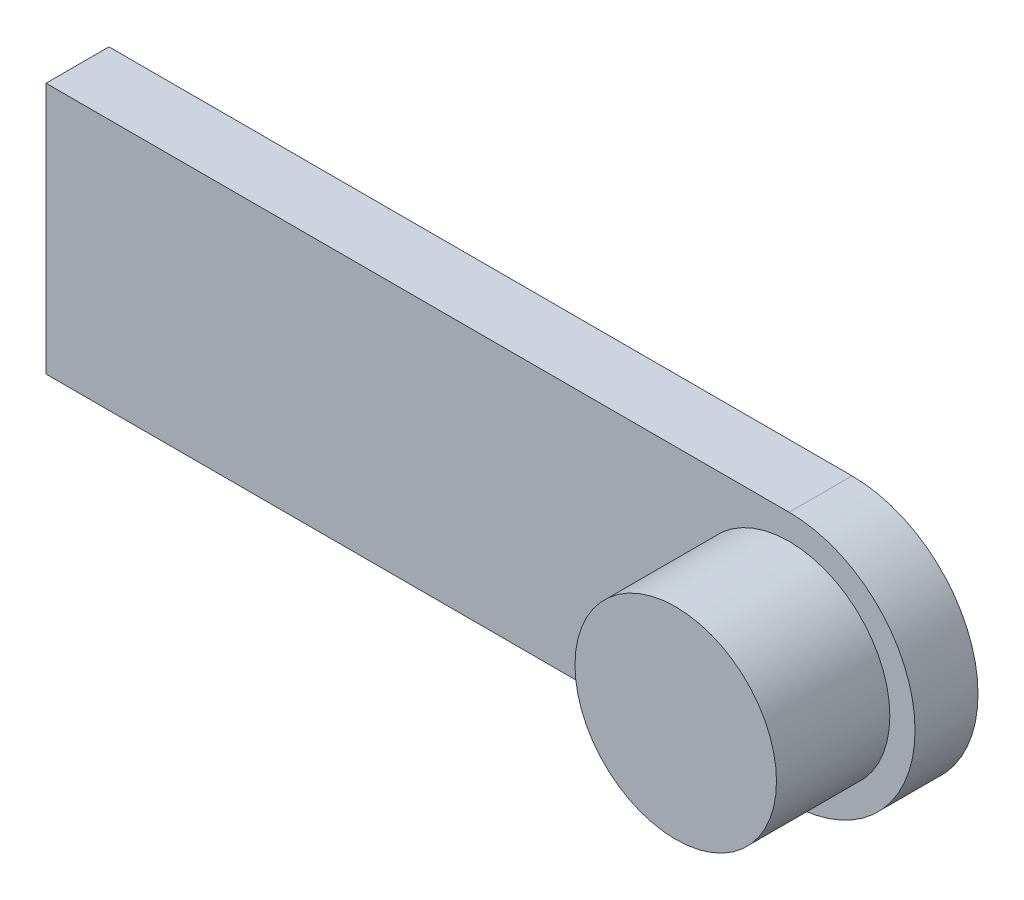
ISO-10303-21;
HEADER;
FILE_DESCRIPTION(('STEP AP214'),'2;1');
FILE_NAME('part.step','',(''),(''),'','','');
FILE_SCHEMA(('AUTOMOTIVE_DESIGN { 1 0 10303 214 1 1 1 1 }'));
ENDSEC;
DATA;
#1=APPLICATION_CONTEXT('core data for automotive mechanical design processes');
#2=APPLICATION_PROTOCOL_DEFINITION('international standard','automotive_design',2000,#1);
#3=PRODUCT_CONTEXT('',#1,'mechanical');
#4=PRODUCT('Part','Part','',(#3));
#5=PRODUCT_RELATED_PRODUCT_CATEGORY('part','',(#4));
#6=PRODUCT_DEFINITION_FORMATION('','',#4);
#7=PRODUCT_DEFINITION_CONTEXT('part definition',#1,'design');
#8=PRODUCT_DEFINITION('design','',#6,#7);
#9=PRODUCT_DEFINITION_SHAPE('','',#8);
#10=(LENGTH_UNIT() NAMED_UNIT(*) SI_UNIT(.MILLI.,.METRE.));
#11=(NAMED_UNIT(*) PLANE_ANGLE_UNIT() SI_UNIT($,.RADIAN.));
#12=(NAMED_UNIT(*) SI_UNIT($,.STERADIAN.) SOLID_ANGLE_UNIT());
#13=UNCERTAINTY_MEASURE_WITH_UNIT(LENGTH_MEASURE(1.E-05),#10,'distance_accuracy_value','');
#14=(GEOMETRIC_REPRESENTATION_CONTEXT(3) GLOBAL_UNCERTAINTY_ASSIGNED_CONTEXT((#13)) GLOBAL_UNIT_ASSIGNED_CONTEXT((#10,
#11,#12)) REPRESENTATION_CONTEXT('',''));
#15=CARTESIAN_POINT('',(0.,0.,0.));
#16=DIRECTION('',(0.,0.,1.));
#17=DIRECTION('',(1.,0.,0.));
#18=AXIS2_PLACEMENT_3D('',#15,#16,#17);
#19=CARTESIAN_POINT('',(0.,0.,0.25));
#20=DIRECTION('',(0.,0.,1.));
#21=DIRECTION('',(0.707106781186548,0.707106781186548,0.));
#22=AXIS2_PLACEMENT_3D('',#19,#20,#21);
#23=PLANE('',#22);
#24=DIRECTION('',(-1.,0.,0.));
#25=VECTOR('',#24,1.);
#26=CARTESIAN_POINT('',(1.4,0.5,0.25));
#27=LINE('',#26,#25);
#28=CARTESIAN_POINT('',(1.4,0.5,0.25));
#29=VERTEX_POINT('',#28);
#30=CARTESIAN_POINT('',(-1.55,0.5,0.25));
#31=VERTEX_POINT('',#30);
#32=EDGE_CURVE('E11',#29,#31,#27,.T.);
#33=ORIENTED_EDGE('',*,*,#32,.T.);
#34=DIRECTION('',(0.,-1.,0.));
#35=VECTOR('',#34,1.);
#36=CARTESIAN_POINT('',(-1.55,0.5,0.25));
#37=LINE('',#36,#35);
#38=CARTESIAN_POINT('',(-1.55,-0.5,0.25));
#39=VERTEX_POINT('',#38);
#40=EDGE_CURVE('E26',#31,#39,#37,.T.);
#41=ORIENTED_EDGE('',*,*,#40,.T.);
#42=DIRECTION('',(1.,0.,0.));
#43=VECTOR('',#42,1.);
#44=CARTESIAN_POINT('',(-1.55,-0.5,0.25));
#45=LINE('',#44,#43);
#46=CARTESIAN_POINT('',(1.4,-0.5,0.25));
#47=VERTEX_POINT('',#46);
#48=EDGE_CURVE('E100',#39,#47,#45,.T.);
#49=ORIENTED_EDGE('',*,*,#48,.T.);
#50=CARTESIAN_POINT('',(1.4,0.,0.25));
#51=DIRECTION('',(0.,0.,1.));
#52=DIRECTION('',(0.,-1.,0.));
#53=AXIS2_PLACEMENT_3D('',#50,#51,#52);
#54=CIRCLE('',#53,0.5);
#55=EDGE_CURVE('E68',#47,#29,#54,.T.);
#56=ORIENTED_EDGE('',*,*,#55,.T.);
#57=EDGE_LOOP('',(#33,#41,#49,#56));
#58=FACE_BOUND('',#57,.T.);
#59=CARTESIAN_POINT('',(1.4,0.,0.25));
#60=DIRECTION('',(0.,0.,1.));
#61=DIRECTION('',(1.,0.,0.));
#62=AXIS2_PLACEMENT_3D('',#59,#60,#61);
#63=CIRCLE('',#62,0.4);
#64=CARTESIAN_POINT('',(1.8,0.,0.25));
#65=VERTEX_POINT('',#64);
#66=EDGE_CURVE('E95',#65,#65,#63,.T.);
#67=ORIENTED_EDGE('',*,*,#66,.F.);
#68=EDGE_LOOP('',(#67));
#69=FACE_BOUND('',#68,.T.);
#70=ADVANCED_FACE('F16',(#58,#69),#23,.T.);
#71=CARTESIAN_POINT('',(1.4,0.,0.25));
#72=DIRECTION('',(0.,0.,1.));
#73=DIRECTION('',(1.,0.,0.));
#74=AXIS2_PLACEMENT_3D('',#71,#72,#73);
#75=CYLINDRICAL_SURFACE('',#74,0.4);
#76=CARTESIAN_POINT('',(1.4,0.,0.7));
#77=DIRECTION('',(0.,0.,1.));
#78=DIRECTION('',(1.,0.,0.));
#79=AXIS2_PLACEMENT_3D('',#76,#77,#78);
#80=CIRCLE('',#79,0.4);
#81=CARTESIAN_POINT('',(1.8,0.,0.7));
#82=VERTEX_POINT('',#81);
#83=EDGE_CURVE('E80',#82,#82,#80,.T.);
#84=ORIENTED_EDGE('',*,*,#83,.F.);
#85=EDGE_LOOP('',(#84));
#86=FACE_BOUND('',#85,.T.);
#87=ORIENTED_EDGE('',*,*,#66,.T.);
#88=EDGE_LOOP('',(#87));
#89=FACE_BOUND('',#88,.T.);
#90=ADVANCED_FACE('F105',(#86,#89),#75,.T.);
#91=CARTESIAN_POINT('',(1.4,0.5,0.));
#92=DIRECTION('',(0.,1.,0.));
#93=DIRECTION('',(0.707106781186548,0.,0.707106781186548));
#94=AXIS2_PLACEMENT_3D('',#91,#92,#93);
#95=PLANE('',#94);
#96=DIRECTION('',(-1.,0.,0.));
#97=VECTOR('',#96,1.);
#98=CARTESIAN_POINT('',(1.4,0.5,0.));
#99=LINE('',#98,#97);
#100=CARTESIAN_POINT('',(1.4,0.5,0.));
#101=VERTEX_POINT('',#100);
#102=CARTESIAN_POINT('',(-1.55,0.5,0.));
#103=VERTEX_POINT('',#102);
#104=EDGE_CURVE('E78',#101,#103,#99,.T.);
#105=ORIENTED_EDGE('',*,*,#104,.T.);
#106=DIRECTION('',(0.,0.,1.));
#107=VECTOR('',#106,1.);
#108=CARTESIAN_POINT('',(-1.55,0.5,0.));
#109=LINE('',#108,#107);
#110=EDGE_CURVE('E86',#103,#31,#109,.T.);
#111=ORIENTED_EDGE('',*,*,#110,.T.);
#112=ORIENTED_EDGE('',*,*,#32,.F.);
#113=DIRECTION('',(0.,0.,1.));
#114=VECTOR('',#113,1.);
#115=CARTESIAN_POINT('',(1.4,0.5,0.));
#116=LINE('',#115,#114);
#117=EDGE_CURVE('E79',#101,#29,#116,.T.);
#118=ORIENTED_EDGE('',*,*,#117,.F.);
#119=EDGE_LOOP('',(#105,#111,#112,#118));
#120=FACE_BOUND('',#119,.T.);
#121=ADVANCED_FACE('F94',(#120),#95,.T.);
#122=CARTESIAN_POINT('',(-1.55,0.5,0.));
#123=DIRECTION('',(-1.,0.,0.));
#124=DIRECTION('',(0.,0.707106781186548,0.707106781186548));
#125=AXIS2_PLACEMENT_3D('',#122,#123,#124);
#126=PLANE('',#125);
#127=DIRECTION('',(0.,-1.,0.));
#128=VECTOR('',#127,1.);
#129=CARTESIAN_POINT('',(-1.55,0.5,0.));
#130=LINE('',#129,#128);
#131=CARTESIAN_POINT('',(-1.55,-0.5,0.));
#132=VERTEX_POINT('',#131);
#133=EDGE_CURVE('E88',#103,#132,#130,.T.);
#134=ORIENTED_EDGE('',*,*,#133,.T.);
#135=DIRECTION('',(0.,0.,1.));
#136=VECTOR('',#135,1.);
#137=CARTESIAN_POINT('',(-1.55,-0.5,0.));
#138=LINE('',#137,#136);
#139=EDGE_CURVE('E57',#132,#39,#138,.T.);
#140=ORIENTED_EDGE('',*,*,#139,.T.);
#141=ORIENTED_EDGE('',*,*,#40,.F.);
#142=ORIENTED_EDGE('',*,*,#110,.F.);
#143=EDGE_LOOP('',(#134,#140,#141,#142));
#144=FACE_BOUND('',#143,.T.);
#145=ADVANCED_FACE('F90',(#144),#126,.T.);
#146=CARTESIAN_POINT('',(-1.55,-0.5,0.));
#147=DIRECTION('',(0.,-1.,0.));
#148=DIRECTION('',(0.707106781186548,0.,0.707106781186548));
#149=AXIS2_PLACEMENT_3D('',#146,#147,#148);
#150=PLANE('',#149);
#151=DIRECTION('',(1.,0.,0.));
#152=VECTOR('',#151,1.);
#153=CARTESIAN_POINT('',(-1.55,-0.5,0.));
#154=LINE('',#153,#152);
#155=CARTESIAN_POINT('',(1.4,-0.5,0.));
#156=VERTEX_POINT('',#155);
#157=EDGE_CURVE('E70',#132,#156,#154,.T.);
#158=ORIENTED_EDGE('',*,*,#157,.T.);
#159=DIRECTION('',(0.,0.,1.));
#160=VECTOR('',#159,1.);
#161=CARTESIAN_POINT('',(1.4,-0.5,0.));
#162=LINE('',#161,#160);
#163=EDGE_CURVE('E63',#156,#47,#162,.T.);
#164=ORIENTED_EDGE('',*,*,#163,.T.);
#165=ORIENTED_EDGE('',*,*,#48,.F.);
#166=ORIENTED_EDGE('',*,*,#139,.F.);
#167=EDGE_LOOP('',(#158,#164,#165,#166));
#168=FACE_BOUND('',#167,.T.);
#169=ADVANCED_FACE('F72',(#168),#150,.T.);
#170=CARTESIAN_POINT('',(1.4,0.,0.));
#171=DIRECTION('',(0.,0.,1.));
#172=DIRECTION('',(0.,-1.,0.));
#173=AXIS2_PLACEMENT_3D('',#170,#171,#172);
#174=CYLINDRICAL_SURFACE('',#173,0.5);
#175=CARTESIAN_POINT('',(1.4,0.,0.));
#176=DIRECTION('',(0.,0.,1.));
#177=DIRECTION('',(0.,-1.,0.));
#178=AXIS2_PLACEMENT_3D('',#175,#176,#177);
#179=CIRCLE('',#178,0.5);
#180=EDGE_CURVE('E20',#156,#101,#179,.T.);
#181=ORIENTED_EDGE('',*,*,#180,.T.);
#182=ORIENTED_EDGE('',*,*,#117,.T.);
#183=ORIENTED_EDGE('',*,*,#55,.F.);
#184=ORIENTED_EDGE('',*,*,#163,.F.);
#185=EDGE_LOOP('',(#181,#182,#183,#184));
#186=FACE_BOUND('',#185,.T.);
#187=ADVANCED_FACE('F64',(#186),#174,.T.);
#188=CARTESIAN_POINT('',(3.45,0.,0.7));
#189=DIRECTION('',(0.,0.,-1.));
#190=DIRECTION('',(0.707106781186548,0.707106781186548,0.));
#191=AXIS2_PLACEMENT_3D('',#188,#189,#190);
#192=PLANE('',#191);
#193=ORIENTED_EDGE('',*,*,#83,.T.);
#194=EDGE_LOOP('',(#193));
#195=FACE_BOUND('',#194,.T.);
#196=ADVANCED_FACE('F122',(#195),#192,.F.);
#197=CARTESIAN_POINT('',(0.,0.,0.));
#198=DIRECTION('',(0.,0.,1.));
#199=DIRECTION('',(0.707106781186548,0.707106781186548,0.));
#200=AXIS2_PLACEMENT_3D('',#197,#198,#199);
#201=PLANE('',#200);
#202=ORIENTED_EDGE('',*,*,#180,.F.);
#203=ORIENTED_EDGE('',*,*,#157,.F.);
#204=ORIENTED_EDGE('',*,*,#133,.F.);
#205=ORIENTED_EDGE('',*,*,#104,.F.);
#206=EDGE_LOOP('',(#202,#203,#204,#205));
#207=FACE_BOUND('',#206,.T.);
#208=ADVANCED_FACE('F18',(#207),#201,.F.);
#209=CLOSED_SHELL('',(#70,#90,#121,#145,#169,#187,#196,#208));
#210=MANIFOLD_SOLID_BREP('B1',#209);
#211=ADVANCED_BREP_SHAPE_REPRESENTATION('',(#18,#210),#14);
#212=SHAPE_DEFINITION_REPRESENTATION(#9,#211);
ENDSEC;
END-ISO-10303-21;
